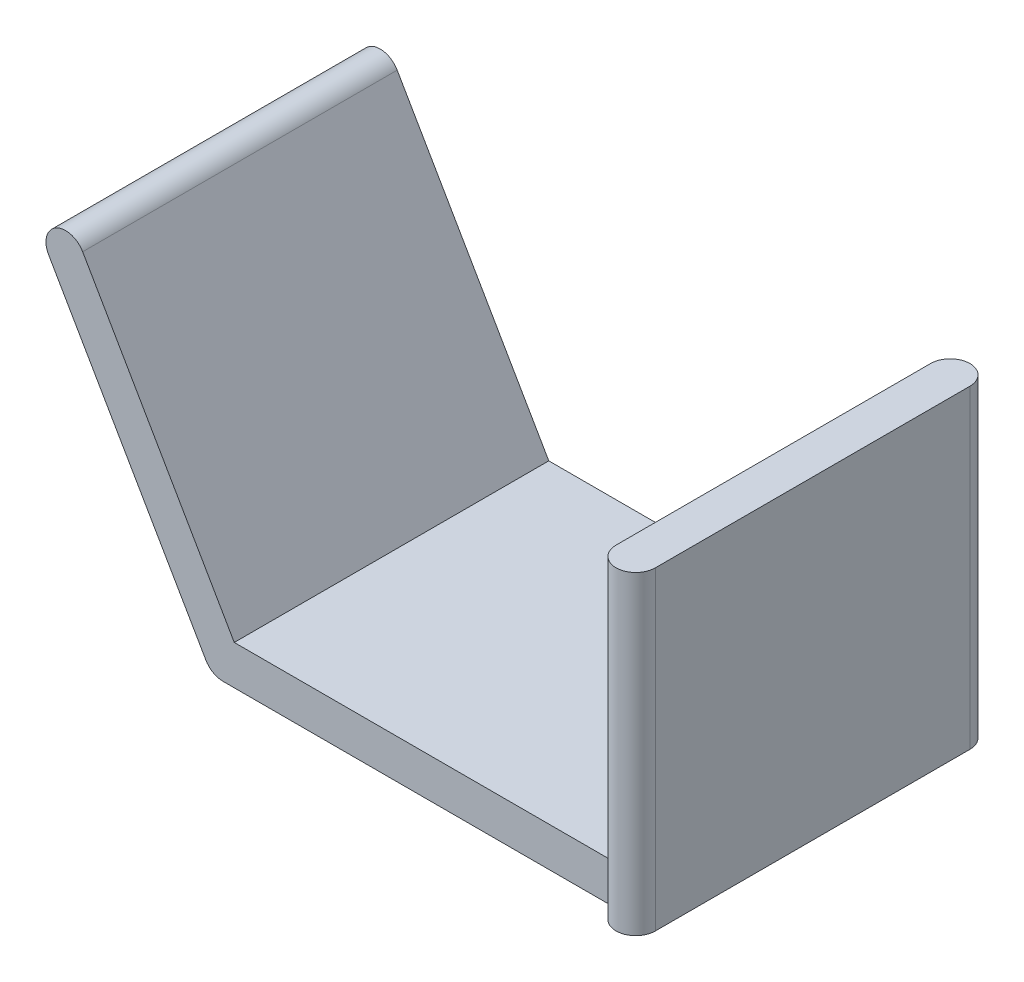
ISO-10303-21;
HEADER;
FILE_DESCRIPTION(('STEP AP214'),'2;1');
FILE_NAME('part.step','',(''),(''),'','','');
FILE_SCHEMA(('AUTOMOTIVE_DESIGN { 1 0 10303 214 1 1 1 1 }'));
ENDSEC;
DATA;
#1=APPLICATION_CONTEXT('core data for automotive mechanical design processes');
#2=APPLICATION_PROTOCOL_DEFINITION('international standard','automotive_design',2000,#1);
#3=PRODUCT_CONTEXT('',#1,'mechanical');
#4=PRODUCT('Part','Part','',(#3));
#5=PRODUCT_RELATED_PRODUCT_CATEGORY('part','',(#4));
#6=PRODUCT_DEFINITION_FORMATION('','',#4);
#7=PRODUCT_DEFINITION_CONTEXT('part definition',#1,'design');
#8=PRODUCT_DEFINITION('design','',#6,#7);
#9=PRODUCT_DEFINITION_SHAPE('','',#8);
#10=(LENGTH_UNIT() NAMED_UNIT(*) SI_UNIT(.MILLI.,.METRE.));
#11=(NAMED_UNIT(*) PLANE_ANGLE_UNIT() SI_UNIT($,.RADIAN.));
#12=(NAMED_UNIT(*) SI_UNIT($,.STERADIAN.) SOLID_ANGLE_UNIT());
#13=UNCERTAINTY_MEASURE_WITH_UNIT(LENGTH_MEASURE(1.E-05),#10,'distance_accuracy_value','');
#14=(GEOMETRIC_REPRESENTATION_CONTEXT(3) GLOBAL_UNCERTAINTY_ASSIGNED_CONTEXT((#13)) GLOBAL_UNIT_ASSIGNED_CONTEXT((#10,
#11,#12)) REPRESENTATION_CONTEXT('',''));
#15=CARTESIAN_POINT('',(0.,0.,0.));
#16=DIRECTION('',(0.,0.,1.));
#17=DIRECTION('',(1.,0.,0.));
#18=AXIS2_PLACEMENT_3D('',#15,#16,#17);
#19=CARTESIAN_POINT('',(-8.42264973081038,1.,16.));
#20=DIRECTION('',(0.,-1.,0.));
#21=DIRECTION('',(1.,0.,0.));
#22=AXIS2_PLACEMENT_3D('',#19,#20,#21);
#23=PLANE('',#22);
#24=DIRECTION('',(-1.,0.,0.));
#25=VECTOR('',#24,1.);
#26=CARTESIAN_POINT('',(9.00000000000005,0.999999999999973,16.));
#27=LINE('',#26,#25);
#28=CARTESIAN_POINT('',(11.,0.999999999999985,16.));
#29=VERTEX_POINT('',#28);
#30=CARTESIAN_POINT('',(-8.42264973081038,1.,16.));
#31=VERTEX_POINT('',#30);
#32=EDGE_CURVE('E88',#29,#31,#27,.T.);
#33=ORIENTED_EDGE('',*,*,#32,.F.);
#34=DIRECTION('',(0.,0.,-1.));
#35=VECTOR('',#34,1.);
#36=CARTESIAN_POINT('',(11.,0.99999999999997,16.));
#37=LINE('',#36,#35);
#38=CARTESIAN_POINT('',(11.,0.999999999999984,0.));
#39=VERTEX_POINT('',#38);
#40=EDGE_CURVE('E178',#29,#39,#37,.T.);
#41=ORIENTED_EDGE('',*,*,#40,.T.);
#42=DIRECTION('',(-1.,0.,0.));
#43=VECTOR('',#42,1.);
#44=CARTESIAN_POINT('',(-8.42264973081038,1.,0.));
#45=LINE('',#44,#43);
#46=CARTESIAN_POINT('',(-8.42264973081038,1.,0.));
#47=VERTEX_POINT('',#46);
#48=EDGE_CURVE('E124',#39,#47,#45,.T.);
#49=ORIENTED_EDGE('',*,*,#48,.T.);
#50=DIRECTION('',(0.,0.,-1.));
#51=VECTOR('',#50,1.);
#52=CARTESIAN_POINT('',(-8.42264973081038,1.,16.));
#53=LINE('',#52,#51);
#54=EDGE_CURVE('E11',#31,#47,#53,.T.);
#55=ORIENTED_EDGE('',*,*,#54,.F.);
#56=EDGE_LOOP('',(#33,#41,#49,#55));
#57=FACE_BOUND('',#56,.T.);
#58=ADVANCED_FACE('F36',(#57),#23,.F.);
#59=CARTESIAN_POINT('',(-8.42264973081038,1.,16.));
#60=DIRECTION('',(-0.866025403784434,-0.500000000000008,0.));
#61=DIRECTION('',(0.500000000000008,-0.866025403784434,0.));
#62=AXIS2_PLACEMENT_3D('',#59,#60,#61);
#63=PLANE('',#62);
#64=DIRECTION('',(-0.500000000000008,0.866025403784434,0.));
#65=VECTOR('',#64,1.);
#66=CARTESIAN_POINT('',(-8.42264973081038,1.,0.));
#67=LINE('',#66,#65);
#68=CARTESIAN_POINT('',(-16.1339745962157,14.356406460551,0.));
#69=VERTEX_POINT('',#68);
#70=EDGE_CURVE('E126',#47,#69,#67,.T.);
#71=ORIENTED_EDGE('',*,*,#70,.T.);
#72=DIRECTION('',(0.,0.,-1.));
#73=VECTOR('',#72,1.);
#74=CARTESIAN_POINT('',(-16.1339745962157,14.356406460551,16.));
#75=LINE('',#74,#73);
#76=CARTESIAN_POINT('',(-16.1339745962157,14.356406460551,16.));
#77=VERTEX_POINT('',#76);
#78=EDGE_CURVE('E43',#77,#69,#75,.T.);
#79=ORIENTED_EDGE('',*,*,#78,.F.);
#80=DIRECTION('',(-0.500000000000008,0.866025403784434,0.));
#81=VECTOR('',#80,1.);
#82=CARTESIAN_POINT('',(-8.42264973081038,1.,16.));
#83=LINE('',#82,#81);
#84=EDGE_CURVE('E102',#31,#77,#83,.T.);
#85=ORIENTED_EDGE('',*,*,#84,.F.);
#86=ORIENTED_EDGE('',*,*,#54,.T.);
#87=EDGE_LOOP('',(#71,#79,#85,#86));
#88=FACE_BOUND('',#87,.T.);
#89=ADVANCED_FACE('F224',(#88),#63,.F.);
#90=CARTESIAN_POINT('',(-17.0000000000001,13.856406460551,16.));
#91=DIRECTION('',(0.,0.,-1.));
#92=DIRECTION('',(-1.,0.,0.));
#93=AXIS2_PLACEMENT_3D('',#90,#91,#92);
#94=CYLINDRICAL_SURFACE('',#93,0.999999999999963);
#95=CARTESIAN_POINT('',(-17.0000000000001,13.856406460551,0.));
#96=DIRECTION('',(0.,0.,1.));
#97=DIRECTION('',(1.,0.,0.));
#98=AXIS2_PLACEMENT_3D('',#95,#96,#97);
#99=CIRCLE('',#98,0.999999999999963);
#100=CARTESIAN_POINT('',(-17.8660254037845,13.356406460551,0.));
#101=VERTEX_POINT('',#100);
#102=EDGE_CURVE('E111',#69,#101,#99,.T.);
#103=ORIENTED_EDGE('',*,*,#102,.T.);
#104=DIRECTION('',(0.,0.,-1.));
#105=VECTOR('',#104,1.);
#106=CARTESIAN_POINT('',(-17.8660254037845,13.356406460551,16.));
#107=LINE('',#106,#105);
#108=CARTESIAN_POINT('',(-17.8660254037845,13.356406460551,16.));
#109=VERTEX_POINT('',#108);
#110=EDGE_CURVE('E108',#109,#101,#107,.T.);
#111=ORIENTED_EDGE('',*,*,#110,.F.);
#112=CARTESIAN_POINT('',(-17.0000000000001,13.856406460551,16.));
#113=DIRECTION('',(0.,0.,1.));
#114=DIRECTION('',(1.,0.,0.));
#115=AXIS2_PLACEMENT_3D('',#112,#113,#114);
#116=CIRCLE('',#115,0.999999999999963);
#117=EDGE_CURVE('E95',#77,#109,#116,.T.);
#118=ORIENTED_EDGE('',*,*,#117,.F.);
#119=ORIENTED_EDGE('',*,*,#78,.T.);
#120=EDGE_LOOP('',(#103,#111,#118,#119));
#121=FACE_BOUND('',#120,.T.);
#122=ADVANCED_FACE('F109',(#121),#94,.T.);
#123=CARTESIAN_POINT('',(-9.86602540378444,-0.500000000000004,16.));
#124=DIRECTION('',(0.866025403784436,0.500000000000004,0.));
#125=DIRECTION('',(-0.500000000000004,0.866025403784436,0.));
#126=AXIS2_PLACEMENT_3D('',#123,#124,#125);
#127=PLANE('',#126);
#128=DIRECTION('',(0.500000000000004,-0.866025403784436,0.));
#129=VECTOR('',#128,1.);
#130=CARTESIAN_POINT('',(-9.86602540378444,-0.500000000000004,0.));
#131=LINE('',#130,#129);
#132=CARTESIAN_POINT('',(-9.86602540378444,-0.500000000000004,0.));
#133=VERTEX_POINT('',#132);
#134=EDGE_CURVE('E130',#101,#133,#131,.T.);
#135=ORIENTED_EDGE('',*,*,#134,.T.);
#136=DIRECTION('',(0.,0.,-1.));
#137=VECTOR('',#136,1.);
#138=CARTESIAN_POINT('',(-9.86602540378444,-0.500000000000004,16.));
#139=LINE('',#138,#137);
#140=CARTESIAN_POINT('',(-9.86602540378444,-0.500000000000004,16.));
#141=VERTEX_POINT('',#140);
#142=EDGE_CURVE('E114',#141,#133,#139,.T.);
#143=ORIENTED_EDGE('',*,*,#142,.F.);
#144=DIRECTION('',(0.500000000000004,-0.866025403784436,0.));
#145=VECTOR('',#144,1.);
#146=CARTESIAN_POINT('',(-9.86602540378444,-0.500000000000004,16.));
#147=LINE('',#146,#145);
#148=EDGE_CURVE('E99',#109,#141,#147,.T.);
#149=ORIENTED_EDGE('',*,*,#148,.F.);
#150=ORIENTED_EDGE('',*,*,#110,.T.);
#151=EDGE_LOOP('',(#135,#143,#149,#150));
#152=FACE_BOUND('',#151,.T.);
#153=ADVANCED_FACE('F116',(#152),#127,.F.);
#154=CARTESIAN_POINT('',(-8.99999999999997,0.,16.));
#155=DIRECTION('',(0.,0.,-1.));
#156=DIRECTION('',(-1.,0.,0.));
#157=AXIS2_PLACEMENT_3D('',#154,#155,#156);
#158=CYLINDRICAL_SURFACE('',#157,1.00000000000004);
#159=CARTESIAN_POINT('',(-8.99999999999997,0.,0.));
#160=DIRECTION('',(0.,0.,1.));
#161=DIRECTION('',(1.,0.,0.));
#162=AXIS2_PLACEMENT_3D('',#159,#160,#161);
#163=CIRCLE('',#162,1.00000000000004);
#164=CARTESIAN_POINT('',(-8.99999999999993,-1.00000000000002,0.));
#165=VERTEX_POINT('',#164);
#166=EDGE_CURVE('E132',#133,#165,#163,.T.);
#167=ORIENTED_EDGE('',*,*,#166,.T.);
#168=DIRECTION('',(0.,0.,-1.));
#169=VECTOR('',#168,1.);
#170=CARTESIAN_POINT('',(-8.99999999999993,-1.00000000000002,16.));
#171=LINE('',#170,#169);
#172=CARTESIAN_POINT('',(-8.99999999999993,-1.00000000000002,16.));
#173=VERTEX_POINT('',#172);
#174=EDGE_CURVE('E123',#173,#165,#171,.T.);
#175=ORIENTED_EDGE('',*,*,#174,.F.);
#176=CARTESIAN_POINT('',(-8.99999999999997,0.,16.));
#177=DIRECTION('',(0.,0.,1.));
#178=DIRECTION('',(1.,0.,0.));
#179=AXIS2_PLACEMENT_3D('',#176,#177,#178);
#180=CIRCLE('',#179,1.00000000000004);
#181=EDGE_CURVE('E56',#141,#173,#180,.T.);
#182=ORIENTED_EDGE('',*,*,#181,.F.);
#183=ORIENTED_EDGE('',*,*,#142,.T.);
#184=EDGE_LOOP('',(#167,#175,#182,#183));
#185=FACE_BOUND('',#184,.T.);
#186=ADVANCED_FACE('F142',(#185),#158,.T.);
#187=CARTESIAN_POINT('',(9.00000000000007,-0.999999999999931,16.));
#188=DIRECTION('',(0.,1.,0.));
#189=DIRECTION('',(-1.,0.,0.));
#190=AXIS2_PLACEMENT_3D('',#187,#188,#189);
#191=PLANE('',#190);
#192=DIRECTION('',(0.,0.,1.));
#193=VECTOR('',#192,1.);
#194=CARTESIAN_POINT('',(13.,-0.999999999999932,16.));
#195=LINE('',#194,#193);
#196=CARTESIAN_POINT('',(13.,-0.999999999999932,0.));
#197=VERTEX_POINT('',#196);
#198=CARTESIAN_POINT('',(13.,-1.00000000000002,16.));
#199=VERTEX_POINT('',#198);
#200=EDGE_CURVE('E127',#197,#199,#195,.T.);
#201=ORIENTED_EDGE('',*,*,#200,.T.);
#202=CARTESIAN_POINT('',(12.,-0.999999999999931,16.));
#203=DIRECTION('',(0.,1.,0.));
#204=DIRECTION('',(-1.,0.,0.));
#205=AXIS2_PLACEMENT_3D('',#202,#203,#204);
#206=CIRCLE('',#205,1.);
#207=CARTESIAN_POINT('',(11.,-0.999999999999922,16.));
#208=VERTEX_POINT('',#207);
#209=EDGE_CURVE('E148',#208,#199,#206,.T.);
#210=ORIENTED_EDGE('',*,*,#209,.F.);
#211=DIRECTION('',(1.,0.,0.));
#212=VECTOR('',#211,1.);
#213=CARTESIAN_POINT('',(-8.99999999999993,-1.00000000000002,16.));
#214=LINE('',#213,#212);
#215=EDGE_CURVE('E50',#173,#208,#214,.T.);
#216=ORIENTED_EDGE('',*,*,#215,.F.);
#217=ORIENTED_EDGE('',*,*,#174,.T.);
#218=DIRECTION('',(1.,0.,0.));
#219=VECTOR('',#218,1.);
#220=CARTESIAN_POINT('',(9.00000000000007,-0.999999999999931,0.));
#221=LINE('',#220,#219);
#222=CARTESIAN_POINT('',(11.,-0.999999999999931,0.));
#223=VERTEX_POINT('',#222);
#224=EDGE_CURVE('E81',#165,#223,#221,.T.);
#225=ORIENTED_EDGE('',*,*,#224,.T.);
#226=CARTESIAN_POINT('',(12.,-0.999999999999931,0.));
#227=DIRECTION('',(0.,1.,0.));
#228=DIRECTION('',(-1.,0.,0.));
#229=AXIS2_PLACEMENT_3D('',#226,#227,#228);
#230=CIRCLE('',#229,1.);
#231=EDGE_CURVE('E161',#197,#223,#230,.T.);
#232=ORIENTED_EDGE('',*,*,#231,.F.);
#233=EDGE_LOOP('',(#201,#210,#216,#217,#225,#232));
#234=FACE_BOUND('',#233,.T.);
#235=ADVANCED_FACE('F146',(#234),#191,.F.);
#236=CARTESIAN_POINT('',(-8.99999999999997,0.,16.));
#237=DIRECTION('',(0.,0.,1.));
#238=DIRECTION('',(1.,0.,0.));
#239=AXIS2_PLACEMENT_3D('',#236,#237,#238);
#240=PLANE('',#239);
#241=DIRECTION('',(0.,1.,0.));
#242=VECTOR('',#241,1.);
#243=CARTESIAN_POINT('',(11.,-0.999999999999931,16.));
#244=LINE('',#243,#242);
#245=EDGE_CURVE('E153',#29,#208,#244,.F.);
#246=ORIENTED_EDGE('',*,*,#245,.F.);
#247=ORIENTED_EDGE('',*,*,#32,.T.);
#248=ORIENTED_EDGE('',*,*,#84,.T.);
#249=ORIENTED_EDGE('',*,*,#117,.T.);
#250=ORIENTED_EDGE('',*,*,#148,.T.);
#251=ORIENTED_EDGE('',*,*,#181,.T.);
#252=ORIENTED_EDGE('',*,*,#215,.T.);
#253=EDGE_LOOP('',(#246,#247,#248,#249,#250,#251,#252));
#254=FACE_BOUND('',#253,.T.);
#255=ADVANCED_FACE('F97',(#254),#240,.T.);
#256=CARTESIAN_POINT('',(-8.99999999999997,0.,0.));
#257=DIRECTION('',(0.,0.,1.));
#258=DIRECTION('',(1.,0.,0.));
#259=AXIS2_PLACEMENT_3D('',#256,#257,#258);
#260=PLANE('',#259);
#261=ORIENTED_EDGE('',*,*,#48,.F.);
#262=DIRECTION('',(0.,1.,0.));
#263=VECTOR('',#262,1.);
#264=CARTESIAN_POINT('',(11.,-0.999999999999931,0.));
#265=LINE('',#264,#263);
#266=EDGE_CURVE('E164',#39,#223,#265,.F.);
#267=ORIENTED_EDGE('',*,*,#266,.T.);
#268=ORIENTED_EDGE('',*,*,#224,.F.);
#269=ORIENTED_EDGE('',*,*,#166,.F.);
#270=ORIENTED_EDGE('',*,*,#134,.F.);
#271=ORIENTED_EDGE('',*,*,#102,.F.);
#272=ORIENTED_EDGE('',*,*,#70,.F.);
#273=EDGE_LOOP('',(#261,#267,#268,#269,#270,#271,#272));
#274=FACE_BOUND('',#273,.T.);
#275=ADVANCED_FACE('F140',(#274),#260,.F.);
#276=CARTESIAN_POINT('',(13.,0.999999999999973,0.));
#277=DIRECTION('',(-1.,0.,0.));
#278=DIRECTION('',(0.,0.,1.));
#279=AXIS2_PLACEMENT_3D('',#276,#277,#278);
#280=PLANE('',#279);
#281=DIRECTION('',(0.,-1.,0.));
#282=VECTOR('',#281,1.);
#283=CARTESIAN_POINT('',(13.,0.999999999999973,0.));
#284=LINE('',#283,#282);
#285=CARTESIAN_POINT('',(13.,15.0000000000001,0.));
#286=VERTEX_POINT('',#285);
#287=EDGE_CURVE('E184',#286,#197,#284,.T.);
#288=ORIENTED_EDGE('',*,*,#287,.F.);
#289=DIRECTION('',(0.,0.,1.));
#290=VECTOR('',#289,1.);
#291=CARTESIAN_POINT('',(13.,15.0000000000001,16.));
#292=LINE('',#291,#290);
#293=CARTESIAN_POINT('',(13.,15.0000000000001,16.));
#294=VERTEX_POINT('',#293);
#295=EDGE_CURVE('E171',#286,#294,#292,.T.);
#296=ORIENTED_EDGE('',*,*,#295,.T.);
#297=DIRECTION('',(0.,-1.,0.));
#298=VECTOR('',#297,1.);
#299=CARTESIAN_POINT('',(13.,0.999999999999973,16.));
#300=LINE('',#299,#298);
#301=EDGE_CURVE('E183',#294,#199,#300,.T.);
#302=ORIENTED_EDGE('',*,*,#301,.T.);
#303=ORIENTED_EDGE('',*,*,#200,.F.);
#304=EDGE_LOOP('',(#288,#296,#302,#303));
#305=FACE_BOUND('',#304,.T.);
#306=ADVANCED_FACE('F192',(#305),#280,.F.);
#307=CARTESIAN_POINT('',(11.,15.0000000000001,16.));
#308=DIRECTION('',(-1.,0.,0.));
#309=DIRECTION('',(0.,0.,1.));
#310=AXIS2_PLACEMENT_3D('',#307,#308,#309);
#311=PLANE('',#310);
#312=ORIENTED_EDGE('',*,*,#40,.F.);
#313=DIRECTION('',(0.,-1.,0.));
#314=VECTOR('',#313,1.);
#315=CARTESIAN_POINT('',(11.,15.0000000000001,16.));
#316=LINE('',#315,#314);
#317=CARTESIAN_POINT('',(11.,15.0000000000001,16.));
#318=VERTEX_POINT('',#317);
#319=EDGE_CURVE('E175',#318,#29,#316,.T.);
#320=ORIENTED_EDGE('',*,*,#319,.F.);
#321=DIRECTION('',(0.,0.,-1.));
#322=VECTOR('',#321,1.);
#323=CARTESIAN_POINT('',(11.,15.0000000000001,16.));
#324=LINE('',#323,#322);
#325=CARTESIAN_POINT('',(11.,15.0000000000001,0.));
#326=VERTEX_POINT('',#325);
#327=EDGE_CURVE('E168',#318,#326,#324,.T.);
#328=ORIENTED_EDGE('',*,*,#327,.T.);
#329=DIRECTION('',(0.,-1.,0.));
#330=VECTOR('',#329,1.);
#331=CARTESIAN_POINT('',(11.,15.0000000000001,0.));
#332=LINE('',#331,#330);
#333=EDGE_CURVE('E174',#326,#39,#332,.T.);
#334=ORIENTED_EDGE('',*,*,#333,.T.);
#335=EDGE_LOOP('',(#312,#320,#328,#334));
#336=FACE_BOUND('',#335,.T.);
#337=ADVANCED_FACE('F211',(#336),#311,.T.);
#338=CARTESIAN_POINT('',(0.,15.0000000000001,0.));
#339=DIRECTION('',(0.,-1.,0.));
#340=DIRECTION('',(1.,0.,0.));
#341=AXIS2_PLACEMENT_3D('',#338,#339,#340);
#342=PLANE('',#341);
#343=ORIENTED_EDGE('',*,*,#327,.F.);
#344=CARTESIAN_POINT('',(12.,15.0000000000001,16.));
#345=DIRECTION('',(0.,1.,0.));
#346=DIRECTION('',(-1.,0.,0.));
#347=AXIS2_PLACEMENT_3D('',#344,#345,#346);
#348=CIRCLE('',#347,1.);
#349=EDGE_CURVE('E154',#318,#294,#348,.T.);
#350=ORIENTED_EDGE('',*,*,#349,.T.);
#351=ORIENTED_EDGE('',*,*,#295,.F.);
#352=CARTESIAN_POINT('',(12.,15.0000000000001,0.));
#353=DIRECTION('',(0.,1.,0.));
#354=DIRECTION('',(-1.,0.,0.));
#355=AXIS2_PLACEMENT_3D('',#352,#353,#354);
#356=CIRCLE('',#355,1.);
#357=EDGE_CURVE('E156',#286,#326,#356,.T.);
#358=ORIENTED_EDGE('',*,*,#357,.T.);
#359=EDGE_LOOP('',(#343,#350,#351,#358));
#360=FACE_BOUND('',#359,.T.);
#361=ADVANCED_FACE('F204',(#360),#342,.F.);
#362=CARTESIAN_POINT('',(12.,-0.999999999999931,0.));
#363=DIRECTION('',(0.,1.,0.));
#364=DIRECTION('',(-1.,0.,0.));
#365=AXIS2_PLACEMENT_3D('',#362,#363,#364);
#366=CYLINDRICAL_SURFACE('',#365,1.);
#367=ORIENTED_EDGE('',*,*,#287,.T.);
#368=ORIENTED_EDGE('',*,*,#231,.T.);
#369=ORIENTED_EDGE('',*,*,#266,.F.);
#370=ORIENTED_EDGE('',*,*,#333,.F.);
#371=ORIENTED_EDGE('',*,*,#357,.F.);
#372=EDGE_LOOP('',(#367,#368,#369,#370,#371));
#373=FACE_BOUND('',#372,.T.);
#374=ADVANCED_FACE('F220',(#373),#366,.T.);
#375=CARTESIAN_POINT('',(12.,-0.999999999999931,16.));
#376=DIRECTION('',(0.,1.,0.));
#377=DIRECTION('',(-1.,0.,0.));
#378=AXIS2_PLACEMENT_3D('',#375,#376,#377);
#379=CYLINDRICAL_SURFACE('',#378,1.);
#380=ORIENTED_EDGE('',*,*,#209,.T.);
#381=ORIENTED_EDGE('',*,*,#301,.F.);
#382=ORIENTED_EDGE('',*,*,#349,.F.);
#383=ORIENTED_EDGE('',*,*,#319,.T.);
#384=ORIENTED_EDGE('',*,*,#245,.T.);
#385=EDGE_LOOP('',(#380,#381,#382,#383,#384));
#386=FACE_BOUND('',#385,.T.);
#387=ADVANCED_FACE('F198',(#386),#379,.T.);
#388=CLOSED_SHELL('',(#58,#89,#122,#153,#186,#235,#255,#275,#306,#337,#361,#374,#387));
#389=MANIFOLD_SOLID_BREP('B2',#388);
#390=ADVANCED_BREP_SHAPE_REPRESENTATION('',(#18,#389),#14);
#391=SHAPE_DEFINITION_REPRESENTATION(#9,#390);
ENDSEC;
END-ISO-10303-21;
